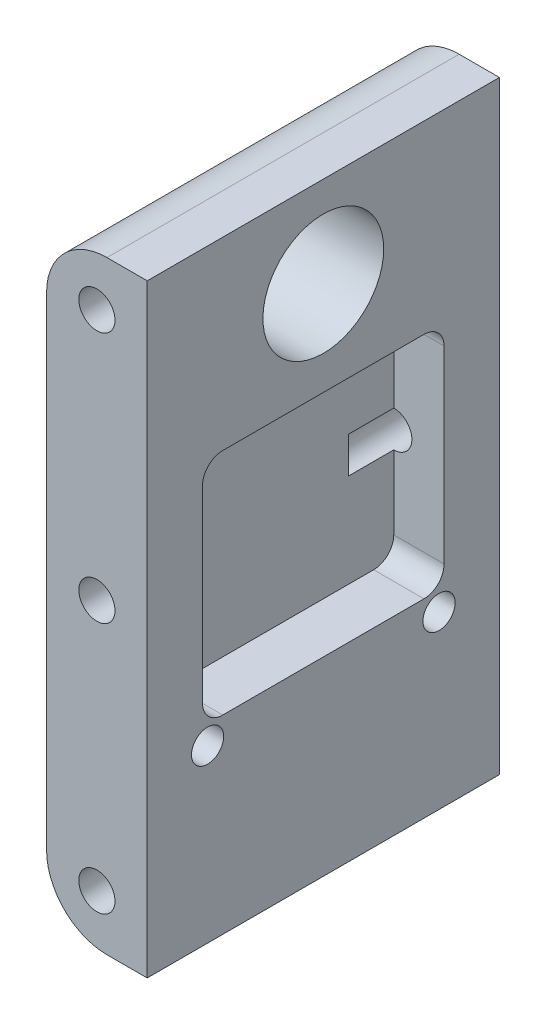
ISO-10303-21;
HEADER;
FILE_DESCRIPTION(('STEP AP214'),'2;1');
FILE_NAME('part.step','',(''),(''),'','','');
FILE_SCHEMA(('AUTOMOTIVE_DESIGN { 1 0 10303 214 1 1 1 1 }'));
ENDSEC;
DATA;
#1=APPLICATION_CONTEXT('core data for automotive mechanical design processes');
#2=APPLICATION_PROTOCOL_DEFINITION('international standard','automotive_design',2000,#1);
#3=PRODUCT_CONTEXT('',#1,'mechanical');
#4=PRODUCT('Part','Part','',(#3));
#5=PRODUCT_RELATED_PRODUCT_CATEGORY('part','',(#4));
#6=PRODUCT_DEFINITION_FORMATION('','',#4);
#7=PRODUCT_DEFINITION_CONTEXT('part definition',#1,'design');
#8=PRODUCT_DEFINITION('design','',#6,#7);
#9=PRODUCT_DEFINITION_SHAPE('','',#8);
#10=(LENGTH_UNIT() NAMED_UNIT(*) SI_UNIT(.MILLI.,.METRE.));
#11=(NAMED_UNIT(*) PLANE_ANGLE_UNIT() SI_UNIT($,.RADIAN.));
#12=(NAMED_UNIT(*) SI_UNIT($,.STERADIAN.) SOLID_ANGLE_UNIT());
#13=UNCERTAINTY_MEASURE_WITH_UNIT(LENGTH_MEASURE(1.E-05),#10,'distance_accuracy_value','');
#14=(GEOMETRIC_REPRESENTATION_CONTEXT(3) GLOBAL_UNCERTAINTY_ASSIGNED_CONTEXT((#13)) GLOBAL_UNIT_ASSIGNED_CONTEXT((#10,
#11,#12)) REPRESENTATION_CONTEXT('',''));
#15=CARTESIAN_POINT('',(0.,0.,0.));
#16=DIRECTION('',(0.,0.,1.));
#17=DIRECTION('',(1.,0.,0.));
#18=AXIS2_PLACEMENT_3D('',#15,#16,#17);
#19=CARTESIAN_POINT('',(10.,0.,0.));
#20=DIRECTION('',(-1.,0.,0.));
#21=DIRECTION('',(0.,0.,1.));
#22=AXIS2_PLACEMENT_3D('',#19,#20,#21);
#23=PLANE('',#22);
#24=DIRECTION('',(0.,0.,1.));
#25=VECTOR('',#24,1.);
#26=CARTESIAN_POINT('',(10.,41.6401580107337,-7.50000000000002));
#27=LINE('',#26,#25);
#28=CARTESIAN_POINT('',(10.,41.6401580107337,-27.5));
#29=VERTEX_POINT('',#28);
#30=CARTESIAN_POINT('',(10.,41.6401580107337,-7.50000000000002));
#31=VERTEX_POINT('',#30);
#32=EDGE_CURVE('E215',#29,#31,#27,.T.);
#33=ORIENTED_EDGE('',*,*,#32,.F.);
#34=CARTESIAN_POINT('',(10.,39.6401580107337,-27.5));
#35=DIRECTION('',(1.,0.,0.));
#36=DIRECTION('',(0.,0.,1.));
#37=AXIS2_PLACEMENT_3D('',#34,#35,#36);
#38=CIRCLE('',#37,2.);
#39=CARTESIAN_POINT('',(10.,39.6401580107337,-29.5));
#40=VERTEX_POINT('',#39);
#41=EDGE_CURVE('E173',#40,#29,#38,.T.);
#42=ORIENTED_EDGE('',*,*,#41,.F.);
#43=DIRECTION('',(0.,1.,0.));
#44=VECTOR('',#43,1.);
#45=CARTESIAN_POINT('',(10.,39.6401580107337,-29.5));
#46=LINE('',#45,#44);
#47=CARTESIAN_POINT('',(10.,20.881008271694,-29.5));
#48=VERTEX_POINT('',#47);
#49=EDGE_CURVE('E192',#48,#40,#46,.T.);
#50=ORIENTED_EDGE('',*,*,#49,.F.);
#51=CARTESIAN_POINT('',(10.,20.881008271694,-27.5));
#52=DIRECTION('',(1.,0.,0.));
#53=DIRECTION('',(0.,0.,1.));
#54=AXIS2_PLACEMENT_3D('',#51,#52,#53);
#55=CIRCLE('',#54,2.);
#56=CARTESIAN_POINT('',(10.,18.881008271694,-27.5));
#57=VERTEX_POINT('',#56);
#58=EDGE_CURVE('E195',#57,#48,#55,.T.);
#59=ORIENTED_EDGE('',*,*,#58,.F.);
#60=DIRECTION('',(0.,0.,-1.));
#61=VECTOR('',#60,1.);
#62=CARTESIAN_POINT('',(10.,18.881008271694,-7.50000000000002));
#63=LINE('',#62,#61);
#64=CARTESIAN_POINT('',(10.,18.881008271694,-7.50000000000002));
#65=VERTEX_POINT('',#64);
#66=EDGE_CURVE('E226',#65,#57,#63,.T.);
#67=ORIENTED_EDGE('',*,*,#66,.F.);
#68=CARTESIAN_POINT('',(10.,20.881008271694,-7.50000000000001));
#69=DIRECTION('',(1.,0.,0.));
#70=DIRECTION('',(0.,0.,-1.));
#71=AXIS2_PLACEMENT_3D('',#68,#69,#70);
#72=CIRCLE('',#71,2.);
#73=CARTESIAN_POINT('',(10.,20.881008271694,-5.50000000000001));
#74=VERTEX_POINT('',#73);
#75=EDGE_CURVE('E223',#74,#65,#72,.T.);
#76=ORIENTED_EDGE('',*,*,#75,.F.);
#77=DIRECTION('',(0.,-1.,0.));
#78=VECTOR('',#77,1.);
#79=CARTESIAN_POINT('',(10.,31.881008271694,-5.50000000000001));
#80=LINE('',#79,#78);
#81=CARTESIAN_POINT('',(10.,39.6401580107337,-5.5));
#82=VERTEX_POINT('',#81);
#83=EDGE_CURVE('E220',#82,#74,#80,.T.);
#84=ORIENTED_EDGE('',*,*,#83,.F.);
#85=CARTESIAN_POINT('',(10.,39.6401580107337,-7.50000000000001));
#86=DIRECTION('',(1.,0.,0.));
#87=DIRECTION('',(0.,0.,1.));
#88=AXIS2_PLACEMENT_3D('',#85,#86,#87);
#89=CIRCLE('',#88,2.);
#90=EDGE_CURVE('E217',#31,#82,#89,.T.);
#91=ORIENTED_EDGE('',*,*,#90,.F.);
#92=EDGE_LOOP('',(#33,#42,#50,#59,#67,#76,#84,#91));
#93=FACE_BOUND('',#92,.T.);
#94=DIRECTION('',(0.,-1.,0.));
#95=VECTOR('',#94,1.);
#96=CARTESIAN_POINT('',(10.,0.,0.));
#97=LINE('',#96,#95);
#98=CARTESIAN_POINT('',(10.,60.,0.));
#99=VERTEX_POINT('',#98);
#100=CARTESIAN_POINT('',(10.,0.,0.));
#101=VERTEX_POINT('',#100);
#102=EDGE_CURVE('E312',#99,#101,#97,.T.);
#103=ORIENTED_EDGE('',*,*,#102,.T.);
#104=DIRECTION('',(0.,0.,-1.));
#105=VECTOR('',#104,1.);
#106=CARTESIAN_POINT('',(10.,0.,0.));
#107=LINE('',#106,#105);
#108=CARTESIAN_POINT('',(10.,0.,-35.));
#109=VERTEX_POINT('',#108);
#110=EDGE_CURVE('E315',#101,#109,#107,.T.);
#111=ORIENTED_EDGE('',*,*,#110,.T.);
#112=DIRECTION('',(0.,1.,0.));
#113=VECTOR('',#112,1.);
#114=CARTESIAN_POINT('',(10.,60.,-35.));
#115=LINE('',#114,#113);
#116=CARTESIAN_POINT('',(10.,60.,-35.));
#117=VERTEX_POINT('',#116);
#118=EDGE_CURVE('E318',#109,#117,#115,.T.);
#119=ORIENTED_EDGE('',*,*,#118,.T.);
#120=DIRECTION('',(0.,0.,1.));
#121=VECTOR('',#120,1.);
#122=CARTESIAN_POINT('',(10.,60.,0.));
#123=LINE('',#122,#121);
#124=EDGE_CURVE('E320',#117,#99,#123,.T.);
#125=ORIENTED_EDGE('',*,*,#124,.T.);
#126=EDGE_LOOP('',(#103,#111,#119,#125));
#127=FACE_BOUND('',#126,.T.);
#128=CARTESIAN_POINT('',(10.,51.,-17.5));
#129=DIRECTION('',(1.,0.,0.));
#130=DIRECTION('',(0.,0.,-1.));
#131=AXIS2_PLACEMENT_3D('',#128,#129,#130);
#132=CIRCLE('',#131,6.);
#133=CARTESIAN_POINT('',(10.,51.,-23.5));
#134=VERTEX_POINT('',#133);
#135=EDGE_CURVE('E307',#134,#134,#132,.T.);
#136=ORIENTED_EDGE('',*,*,#135,.F.);
#137=EDGE_LOOP('',(#136));
#138=FACE_BOUND('',#137,.T.);
#139=CARTESIAN_POINT('',(10.,17.,-6.));
#140=DIRECTION('',(1.,0.,0.));
#141=DIRECTION('',(0.,0.,-1.));
#142=AXIS2_PLACEMENT_3D('',#139,#140,#141);
#143=CIRCLE('',#142,1.6);
#144=CARTESIAN_POINT('',(10.,17.,-7.6));
#145=VERTEX_POINT('',#144);
#146=EDGE_CURVE('E301',#145,#145,#143,.T.);
#147=ORIENTED_EDGE('',*,*,#146,.F.);
#148=EDGE_LOOP('',(#147));
#149=FACE_BOUND('',#148,.T.);
#150=CARTESIAN_POINT('',(10.,17.,-29.));
#151=DIRECTION('',(1.,0.,0.));
#152=DIRECTION('',(0.,0.,-1.));
#153=AXIS2_PLACEMENT_3D('',#150,#151,#152);
#154=CIRCLE('',#153,1.6);
#155=CARTESIAN_POINT('',(10.,17.,-30.6));
#156=VERTEX_POINT('',#155);
#157=EDGE_CURVE('E295',#156,#156,#154,.T.);
#158=ORIENTED_EDGE('',*,*,#157,.F.);
#159=EDGE_LOOP('',(#158));
#160=FACE_BOUND('',#159,.T.);
#161=ADVANCED_FACE('F34',(#93,#127,#138,#149,#160),#23,.F.);
#162=CARTESIAN_POINT('',(0.,0.,0.));
#163=DIRECTION('',(-1.,0.,0.));
#164=DIRECTION('',(0.,0.,1.));
#165=AXIS2_PLACEMENT_3D('',#162,#163,#164);
#166=PLANE('',#165);
#167=CARTESIAN_POINT('',(0.,17.,-6.));
#168=DIRECTION('',(1.,0.,0.));
#169=DIRECTION('',(0.,0.,-1.));
#170=AXIS2_PLACEMENT_3D('',#167,#168,#169);
#171=CIRCLE('',#170,1.6);
#172=CARTESIAN_POINT('',(0.,17.,-7.6));
#173=VERTEX_POINT('',#172);
#174=EDGE_CURVE('E298',#173,#173,#171,.T.);
#175=ORIENTED_EDGE('',*,*,#174,.T.);
#176=EDGE_LOOP('',(#175));
#177=FACE_BOUND('',#176,.T.);
#178=DIRECTION('',(0.,-1.,0.));
#179=VECTOR('',#178,1.);
#180=CARTESIAN_POINT('',(0.,0.,0.));
#181=LINE('',#180,#179);
#182=CARTESIAN_POINT('',(0.,54.,0.));
#183=VERTEX_POINT('',#182);
#184=CARTESIAN_POINT('',(0.,6.,0.));
#185=VERTEX_POINT('',#184);
#186=EDGE_CURVE('E310',#183,#185,#181,.T.);
#187=ORIENTED_EDGE('',*,*,#186,.F.);
#188=DIRECTION('',(0.,0.,1.));
#189=VECTOR('',#188,1.);
#190=CARTESIAN_POINT('',(0.,54.,-35.));
#191=LINE('',#190,#189);
#192=CARTESIAN_POINT('',(0.,54.,-12.3038475772934));
#193=VERTEX_POINT('',#192);
#194=EDGE_CURVE('E56',#183,#193,#191,.F.);
#195=ORIENTED_EDGE('',*,*,#194,.T.);
#196=CARTESIAN_POINT('',(0.,51.,-17.5));
#197=DIRECTION('',(1.,0.,0.));
#198=DIRECTION('',(0.,0.,-1.));
#199=AXIS2_PLACEMENT_3D('',#196,#197,#198);
#200=CIRCLE('',#199,6.);
#201=CARTESIAN_POINT('',(0.,54.,-22.6961524227066));
#202=VERTEX_POINT('',#201);
#203=EDGE_CURVE('E304',#193,#202,#200,.T.);
#204=ORIENTED_EDGE('',*,*,#203,.T.);
#205=DIRECTION('',(0.,0.,1.));
#206=VECTOR('',#205,1.);
#207=CARTESIAN_POINT('',(0.,54.,-35.));
#208=LINE('',#207,#206);
#209=CARTESIAN_POINT('',(0.,54.,-35.));
#210=VERTEX_POINT('',#209);
#211=EDGE_CURVE('E355',#202,#210,#208,.F.);
#212=ORIENTED_EDGE('',*,*,#211,.T.);
#213=DIRECTION('',(0.,1.,0.));
#214=VECTOR('',#213,1.);
#215=CARTESIAN_POINT('',(0.,60.,-35.));
#216=LINE('',#215,#214);
#217=CARTESIAN_POINT('',(0.,6.,-35.));
#218=VERTEX_POINT('',#217);
#219=EDGE_CURVE('E316',#218,#210,#216,.T.);
#220=ORIENTED_EDGE('',*,*,#219,.F.);
#221=DIRECTION('',(0.,0.,-1.));
#222=VECTOR('',#221,1.);
#223=CARTESIAN_POINT('',(0.,6.,0.));
#224=LINE('',#223,#222);
#225=EDGE_CURVE('E353',#218,#185,#224,.F.);
#226=ORIENTED_EDGE('',*,*,#225,.T.);
#227=EDGE_LOOP('',(#187,#195,#204,#212,#220,#226));
#228=FACE_BOUND('',#227,.T.);
#229=CARTESIAN_POINT('',(0.,17.,-29.));
#230=DIRECTION('',(1.,0.,0.));
#231=DIRECTION('',(0.,0.,-1.));
#232=AXIS2_PLACEMENT_3D('',#229,#230,#231);
#233=CIRCLE('',#232,1.6);
#234=CARTESIAN_POINT('',(0.,17.,-30.6));
#235=VERTEX_POINT('',#234);
#236=EDGE_CURVE('E280',#235,#235,#233,.T.);
#237=ORIENTED_EDGE('',*,*,#236,.T.);
#238=EDGE_LOOP('',(#237));
#239=FACE_BOUND('',#238,.T.);
#240=ADVANCED_FACE('F378',(#177,#228,#239),#166,.T.);
#241=CARTESIAN_POINT('',(10.,0.,0.));
#242=DIRECTION('',(0.,0.,-1.));
#243=DIRECTION('',(-1.,0.,0.));
#244=AXIS2_PLACEMENT_3D('',#241,#242,#243);
#245=PLANE('',#244);
#246=CARTESIAN_POINT('',(5.,55.,0.));
#247=DIRECTION('',(0.,0.,1.));
#248=DIRECTION('',(1.,0.,0.));
#249=AXIS2_PLACEMENT_3D('',#246,#247,#248);
#250=CIRCLE('',#249,1.8);
#251=CARTESIAN_POINT('',(6.8,55.,0.));
#252=VERTEX_POINT('',#251);
#253=EDGE_CURVE('E263',#252,#252,#250,.T.);
#254=ORIENTED_EDGE('',*,*,#253,.F.);
#255=EDGE_LOOP('',(#254));
#256=FACE_BOUND('',#255,.T.);
#257=CARTESIAN_POINT('',(5.00000000000026,30.,0.));
#258=DIRECTION('',(0.,0.,1.));
#259=DIRECTION('',(1.,0.,0.));
#260=AXIS2_PLACEMENT_3D('',#257,#258,#259);
#261=CIRCLE('',#260,1.8);
#262=CARTESIAN_POINT('',(6.80000000000026,30.,0.));
#263=VERTEX_POINT('',#262);
#264=EDGE_CURVE('E269',#263,#263,#261,.T.);
#265=ORIENTED_EDGE('',*,*,#264,.F.);
#266=EDGE_LOOP('',(#265));
#267=FACE_BOUND('',#266,.T.);
#268=CARTESIAN_POINT('',(5.00000000000052,5.,0.));
#269=DIRECTION('',(0.,0.,1.));
#270=DIRECTION('',(1.,0.,0.));
#271=AXIS2_PLACEMENT_3D('',#268,#269,#270);
#272=CIRCLE('',#271,1.8);
#273=CARTESIAN_POINT('',(6.80000000000052,5.,0.));
#274=VERTEX_POINT('',#273);
#275=EDGE_CURVE('E258',#274,#274,#272,.T.);
#276=ORIENTED_EDGE('',*,*,#275,.F.);
#277=EDGE_LOOP('',(#276));
#278=FACE_BOUND('',#277,.T.);
#279=DIRECTION('',(-1.,0.,0.));
#280=VECTOR('',#279,1.);
#281=CARTESIAN_POINT('',(10.,60.,0.));
#282=LINE('',#281,#280);
#283=CARTESIAN_POINT('',(6.,60.,0.));
#284=VERTEX_POINT('',#283);
#285=EDGE_CURVE('E322',#99,#284,#282,.T.);
#286=ORIENTED_EDGE('',*,*,#285,.T.);
#287=CARTESIAN_POINT('',(6.,54.,0.));
#288=DIRECTION('',(0.,0.,-1.));
#289=DIRECTION('',(-1.,0.,0.));
#290=AXIS2_PLACEMENT_3D('',#287,#288,#289);
#291=CIRCLE('',#290,6.);
#292=EDGE_CURVE('E351',#284,#183,#291,.F.);
#293=ORIENTED_EDGE('',*,*,#292,.T.);
#294=ORIENTED_EDGE('',*,*,#186,.T.);
#295=CARTESIAN_POINT('',(6.,6.,0.));
#296=DIRECTION('',(0.,0.,-1.));
#297=DIRECTION('',(-1.,0.,0.));
#298=AXIS2_PLACEMENT_3D('',#295,#296,#297);
#299=CIRCLE('',#298,6.);
#300=CARTESIAN_POINT('',(6.,0.,0.));
#301=VERTEX_POINT('',#300);
#302=EDGE_CURVE('E349',#185,#301,#299,.F.);
#303=ORIENTED_EDGE('',*,*,#302,.T.);
#304=DIRECTION('',(-1.,0.,0.));
#305=VECTOR('',#304,1.);
#306=CARTESIAN_POINT('',(10.,0.,0.));
#307=LINE('',#306,#305);
#308=EDGE_CURVE('E335',#101,#301,#307,.T.);
#309=ORIENTED_EDGE('',*,*,#308,.F.);
#310=ORIENTED_EDGE('',*,*,#102,.F.);
#311=EDGE_LOOP('',(#286,#293,#294,#303,#309,#310));
#312=FACE_BOUND('',#311,.T.);
#313=ADVANCED_FACE('F374',(#256,#267,#278,#312),#245,.F.);
#314=CARTESIAN_POINT('',(10.,0.,0.));
#315=DIRECTION('',(0.,1.,0.));
#316=DIRECTION('',(0.,0.,1.));
#317=AXIS2_PLACEMENT_3D('',#314,#315,#316);
#318=PLANE('',#317);
#319=ORIENTED_EDGE('',*,*,#308,.T.);
#320=DIRECTION('',(0.,0.,-1.));
#321=VECTOR('',#320,1.);
#322=CARTESIAN_POINT('',(6.,0.,-35.));
#323=LINE('',#322,#321);
#324=CARTESIAN_POINT('',(6.,0.,-35.));
#325=VERTEX_POINT('',#324);
#326=EDGE_CURVE('E11',#301,#325,#323,.T.);
#327=ORIENTED_EDGE('',*,*,#326,.T.);
#328=DIRECTION('',(-1.,0.,0.));
#329=VECTOR('',#328,1.);
#330=CARTESIAN_POINT('',(10.,0.,-35.));
#331=LINE('',#330,#329);
#332=EDGE_CURVE('E332',#109,#325,#331,.T.);
#333=ORIENTED_EDGE('',*,*,#332,.F.);
#334=ORIENTED_EDGE('',*,*,#110,.F.);
#335=EDGE_LOOP('',(#319,#327,#333,#334));
#336=FACE_BOUND('',#335,.T.);
#337=ADVANCED_FACE('F377',(#336),#318,.F.);
#338=CARTESIAN_POINT('',(10.,60.,-35.));
#339=DIRECTION('',(0.,0.,1.));
#340=DIRECTION('',(1.,0.,0.));
#341=AXIS2_PLACEMENT_3D('',#338,#339,#340);
#342=PLANE('',#341);
#343=CARTESIAN_POINT('',(5.,55.,-35.));
#344=DIRECTION('',(0.,0.,-1.));
#345=DIRECTION('',(-1.,0.,0.));
#346=AXIS2_PLACEMENT_3D('',#343,#344,#345);
#347=CIRCLE('',#346,1.8);
#348=CARTESIAN_POINT('',(3.2,55.,-35.));
#349=VERTEX_POINT('',#348);
#350=EDGE_CURVE('E281',#349,#349,#347,.T.);
#351=ORIENTED_EDGE('',*,*,#350,.F.);
#352=EDGE_LOOP('',(#351));
#353=FACE_BOUND('',#352,.T.);
#354=CARTESIAN_POINT('',(4.99999999999974,30.,-35.));
#355=DIRECTION('',(0.,0.,-1.));
#356=DIRECTION('',(-1.,0.,0.));
#357=AXIS2_PLACEMENT_3D('',#354,#355,#356);
#358=CIRCLE('',#357,1.8);
#359=CARTESIAN_POINT('',(3.19999999999974,30.,-35.));
#360=VERTEX_POINT('',#359);
#361=EDGE_CURVE('E287',#360,#360,#358,.T.);
#362=ORIENTED_EDGE('',*,*,#361,.F.);
#363=EDGE_LOOP('',(#362));
#364=FACE_BOUND('',#363,.T.);
#365=CARTESIAN_POINT('',(4.99999999999948,5.,-35.));
#366=DIRECTION('',(0.,0.,-1.));
#367=DIRECTION('',(-1.,0.,0.));
#368=AXIS2_PLACEMENT_3D('',#365,#366,#367);
#369=CIRCLE('',#368,1.8);
#370=CARTESIAN_POINT('',(3.19999999999948,5.,-35.));
#371=VERTEX_POINT('',#370);
#372=EDGE_CURVE('E262',#371,#371,#369,.T.);
#373=ORIENTED_EDGE('',*,*,#372,.F.);
#374=EDGE_LOOP('',(#373));
#375=FACE_BOUND('',#374,.T.);
#376=ORIENTED_EDGE('',*,*,#219,.T.);
#377=CARTESIAN_POINT('',(6.,54.,-35.));
#378=DIRECTION('',(0.,0.,1.));
#379=DIRECTION('',(1.,0.,0.));
#380=AXIS2_PLACEMENT_3D('',#377,#378,#379);
#381=CIRCLE('',#380,6.);
#382=CARTESIAN_POINT('',(6.,60.,-35.));
#383=VERTEX_POINT('',#382);
#384=EDGE_CURVE('E42',#210,#383,#381,.F.);
#385=ORIENTED_EDGE('',*,*,#384,.T.);
#386=DIRECTION('',(-1.,0.,0.));
#387=VECTOR('',#386,1.);
#388=CARTESIAN_POINT('',(10.,60.,-35.));
#389=LINE('',#388,#387);
#390=EDGE_CURVE('E329',#117,#383,#389,.T.);
#391=ORIENTED_EDGE('',*,*,#390,.F.);
#392=ORIENTED_EDGE('',*,*,#118,.F.);
#393=ORIENTED_EDGE('',*,*,#332,.T.);
#394=CARTESIAN_POINT('',(6.,6.,-35.));
#395=DIRECTION('',(0.,0.,1.));
#396=DIRECTION('',(1.,0.,0.));
#397=AXIS2_PLACEMENT_3D('',#394,#395,#396);
#398=CIRCLE('',#397,6.);
#399=EDGE_CURVE('E49',#325,#218,#398,.F.);
#400=ORIENTED_EDGE('',*,*,#399,.T.);
#401=EDGE_LOOP('',(#376,#385,#391,#392,#393,#400));
#402=FACE_BOUND('',#401,.T.);
#403=ADVANCED_FACE('F382',(#353,#364,#375,#402),#342,.F.);
#404=CARTESIAN_POINT('',(10.,60.,0.));
#405=DIRECTION('',(0.,-1.,0.));
#406=DIRECTION('',(0.,0.,-1.));
#407=AXIS2_PLACEMENT_3D('',#404,#405,#406);
#408=PLANE('',#407);
#409=ORIENTED_EDGE('',*,*,#390,.T.);
#410=DIRECTION('',(0.,0.,1.));
#411=VECTOR('',#410,1.);
#412=CARTESIAN_POINT('',(6.,60.,0.));
#413=LINE('',#412,#411);
#414=EDGE_CURVE('E346',#383,#284,#413,.T.);
#415=ORIENTED_EDGE('',*,*,#414,.T.);
#416=ORIENTED_EDGE('',*,*,#285,.F.);
#417=ORIENTED_EDGE('',*,*,#124,.F.);
#418=EDGE_LOOP('',(#409,#415,#416,#417));
#419=FACE_BOUND('',#418,.T.);
#420=ADVANCED_FACE('F386',(#419),#408,.F.);
#421=CARTESIAN_POINT('',(10.,51.,-17.5));
#422=DIRECTION('',(-1.,0.,0.));
#423=DIRECTION('',(0.,0.,1.));
#424=AXIS2_PLACEMENT_3D('',#421,#422,#423);
#425=CYLINDRICAL_SURFACE('',#424,6.);
#426=ORIENTED_EDGE('',*,*,#135,.T.);
#427=EDGE_LOOP('',(#426));
#428=FACE_BOUND('',#427,.T.);
#429=ORIENTED_EDGE('',*,*,#203,.F.);
#430=CARTESIAN_POINT('',(0.,54.,-12.3038475772934));
#431=CARTESIAN_POINT('',(-1.70318691964767E-05,54.138971489971,-12.3840486609694));
#432=CARTESIAN_POINT('',(0.004826564341127,54.2746087440341,-12.4698234963983));
#433=CARTESIAN_POINT('',(0.0227239424648481,54.5380740534339,-12.6515453539032));
#434=CARTESIAN_POINT('',(0.0357670906650158,54.6659119882295,-12.747479067494));
#435=CARTESIAN_POINT('',(0.0684624467663157,54.9122658926771,-12.9481552580847));
#436=CARTESIAN_POINT('',(0.0880747779846383,55.0308329071765,-13.0528417927466));
#437=CARTESIAN_POINT('',(0.132395671677967,55.2588578109537,-13.2706941914864));
#438=CARTESIAN_POINT('',(0.157105871638557,55.3683127574512,-13.3838627726258));
#439=CARTESIAN_POINT('',(0.2363738701154,55.6812857302597,-13.7339552919189));
#440=CARTESIAN_POINT('',(0.296277933209233,55.8707497970105,-13.9825625930407));
#441=CARTESIAN_POINT('',(0.387873584499626,56.1241866180133,-14.3747622922179));
#442=CARTESIAN_POINT('',(0.418742446001198,56.2036338384799,-14.508923554784));
#443=CARTESIAN_POINT('',(0.479610319044134,56.3519592810563,-14.7832350066012));
#444=CARTESIAN_POINT('',(0.50960924488321,56.4208364647014,-14.9233857825714));
#445=CARTESIAN_POINT('',(0.57008725692433,56.553801168399,-15.2230007441497));
#446=CARTESIAN_POINT('',(0.600326834879387,56.6167630432964,-15.3830139628661));
#447=CARTESIAN_POINT('',(0.656120625714184,56.7288967700485,-15.708533221189));
#448=CARTESIAN_POINT('',(0.681676907906104,56.7780747174361,-15.874036796521));
#449=CARTESIAN_POINT('',(0.726396540192259,56.8620575418262,-16.2092319722415));
#450=CARTESIAN_POINT('',(0.745569989964516,56.8968851466135,-16.3789164956155));
#451=CARTESIAN_POINT('',(0.7762114546111,56.9517844390372,-16.721339033517));
#452=CARTESIAN_POINT('',(0.787680699206749,56.9718584816397,-16.8940765562146));
#453=CARTESIAN_POINT('',(0.801430111553232,56.9958369707298,-17.2258699949614));
#454=CARTESIAN_POINT('',(0.804423916108371,57.0009979900945,-17.3848064852442));
#455=CARTESIAN_POINT('',(0.803087652985968,56.9986840201315,-17.7025528520796));
#456=CARTESIAN_POINT('',(0.798757931373836,56.9912096278766,-17.8613627342602));
#457=CARTESIAN_POINT('',(0.783051709346282,56.9637303076266,-18.1775843979837));
#458=CARTESIAN_POINT('',(0.771672956141471,56.9437213737133,-18.3349957162419));
#459=CARTESIAN_POINT('',(0.74258001036149,56.8914400770858,-18.6471630649126));
#460=CARTESIAN_POINT('',(0.724865730184451,56.8591675448015,-18.8019190585787));
#461=CARTESIAN_POINT('',(0.685478607930235,56.7852280548295,-19.0977630415463));
#462=CARTESIAN_POINT('',(0.664139298092433,56.7443110873645,-19.2390841758154));
#463=CARTESIAN_POINT('',(0.617873224520897,56.6524235210254,-19.5178348107684));
#464=CARTESIAN_POINT('',(0.592945361557728,56.601449839845,-19.6552631035213));
#465=CARTESIAN_POINT('',(0.514428407863169,56.4338799823086,-20.0609774484928));
#466=CARTESIAN_POINT('',(0.457117523498166,56.3026548260349,-20.322614360533));
#467=CARTESIAN_POINT('',(0.334333473326662,55.9832379765415,-20.858159459369));
#468=CARTESIAN_POINT('',(0.268807912423602,55.7897327274657,-21.1289159349087));
#469=CARTESIAN_POINT('',(0.181050536064394,55.4670543183315,-21.5091186441178));
#470=CARTESIAN_POINT('',(0.153568408184191,55.3541794816466,-21.6314562222759));
#471=CARTESIAN_POINT('',(0.103862999574718,55.118083219865,-21.8668238822048));
#472=CARTESIAN_POINT('',(0.081637108831873,54.9948669712111,-21.9798585651222));
#473=CARTESIAN_POINT('',(0.0433054162393705,54.7322837248737,-22.2011658255451));
#474=CARTESIAN_POINT('',(0.0275648439157112,54.5924155759533,-22.3089106488047));
#475=CARTESIAN_POINT('',(0.0058941424161629,54.3030711086184,-22.5121006928568));
#476=CARTESIAN_POINT('',(-2.41089792427208E-05,54.1535833840671,-22.6075308936609));
#477=CARTESIAN_POINT('',(0.,54.,-22.6961524227066));
#478=B_SPLINE_CURVE_WITH_KNOTS('',3,(#430,#431,#432,#433,#434,#435,#436,#437,#438,#439,#440,
#441,#442,#443,#444,#445,#446,#447,#448,#449,#450,#451,#452,#453,#454,#455,#456,#457,#458,#459,
#460,#461,#462,#463,#464,#465,#466,#467,#468,#469,#470,#471,#472,#473,#474,#475,#476,#477),
.UNSPECIFIED.,.F.,.F.,(4,2,2,2,2,2,2,2,2,2,2,2,2,2,2,2,2,2,2,2,2,2,2,4),(0.,0.481007244724744,
0.96139197115481,1.43891194475274,1.91658554194476,2.86676478085739,3.34326908663013,
3.81982017715403,4.34293663731535,4.86582139843953,5.38787481215915,5.90984487751972,
6.38633112647706,6.86279486021444,7.33941094489037,7.816033620032,8.26157062121815,
8.70724438883857,9.5988350843745,10.6113996532194,11.1169923893763,11.6223335410446,
12.1531632104413,12.6846343266553),.UNSPECIFIED.);
#479=EDGE_CURVE('E358',#193,#202,#478,.T.);
#480=ORIENTED_EDGE('',*,*,#479,.T.);
#481=EDGE_LOOP('',(#429,#480));
#482=FACE_BOUND('',#481,.T.);
#483=ADVANCED_FACE('F365',(#428,#482),#425,.F.);
#484=CARTESIAN_POINT('',(10.,17.,-6.));
#485=DIRECTION('',(-1.,0.,0.));
#486=DIRECTION('',(0.,0.,1.));
#487=AXIS2_PLACEMENT_3D('',#484,#485,#486);
#488=CYLINDRICAL_SURFACE('',#487,1.6);
#489=ORIENTED_EDGE('',*,*,#146,.T.);
#490=EDGE_LOOP('',(#489));
#491=FACE_BOUND('',#490,.T.);
#492=ORIENTED_EDGE('',*,*,#174,.F.);
#493=EDGE_LOOP('',(#492));
#494=FACE_BOUND('',#493,.T.);
#495=ADVANCED_FACE('F412',(#491,#494),#488,.F.);
#496=CARTESIAN_POINT('',(10.,17.,-29.));
#497=DIRECTION('',(-1.,0.,0.));
#498=DIRECTION('',(0.,0.,1.));
#499=AXIS2_PLACEMENT_3D('',#496,#497,#498);
#500=CYLINDRICAL_SURFACE('',#499,1.6);
#501=ORIENTED_EDGE('',*,*,#157,.T.);
#502=EDGE_LOOP('',(#501));
#503=FACE_BOUND('',#502,.T.);
#504=ORIENTED_EDGE('',*,*,#236,.F.);
#505=EDGE_LOOP('',(#504));
#506=FACE_BOUND('',#505,.T.);
#507=ADVANCED_FACE('F408',(#503,#506),#500,.F.);
#508=CARTESIAN_POINT('',(4.99999999999948,5.,-25.));
#509=DIRECTION('',(0.,0.,-1.));
#510=DIRECTION('',(-1.,0.,0.));
#511=AXIS2_PLACEMENT_3D('',#508,#509,#510);
#512=CYLINDRICAL_SURFACE('',#511,1.8);
#513=CARTESIAN_POINT('',(4.99999999999948,5.,-25.));
#514=DIRECTION('',(0.,0.,-1.));
#515=DIRECTION('',(-1.,0.,0.));
#516=AXIS2_PLACEMENT_3D('',#513,#514,#515);
#517=CIRCLE('',#516,1.8);
#518=CARTESIAN_POINT('',(3.19999999999948,5.,-25.));
#519=VERTEX_POINT('',#518);
#520=EDGE_CURVE('E290',#519,#519,#517,.T.);
#521=ORIENTED_EDGE('',*,*,#520,.F.);
#522=EDGE_LOOP('',(#521));
#523=FACE_BOUND('',#522,.T.);
#524=ORIENTED_EDGE('',*,*,#372,.T.);
#525=EDGE_LOOP('',(#524));
#526=FACE_BOUND('',#525,.T.);
#527=ADVANCED_FACE('F411',(#523,#526),#512,.F.);
#528=CARTESIAN_POINT('',(4.99999999999948,5.,-25.));
#529=DIRECTION('',(0.,0.,-1.));
#530=DIRECTION('',(-1.,0.,0.));
#531=AXIS2_PLACEMENT_3D('',#528,#529,#530);
#532=PLANE('',#531);
#533=ORIENTED_EDGE('',*,*,#520,.T.);
#534=EDGE_LOOP('',(#533));
#535=FACE_BOUND('',#534,.T.);
#536=ADVANCED_FACE('F420',(#535),#532,.T.);
#537=CARTESIAN_POINT('',(4.99999999999974,30.,-25.));
#538=DIRECTION('',(0.,0.,-1.));
#539=DIRECTION('',(-1.,0.,0.));
#540=AXIS2_PLACEMENT_3D('',#537,#538,#539);
#541=CYLINDRICAL_SURFACE('',#540,1.8);
#542=CARTESIAN_POINT('',(4.99999999999974,30.,-29.5));
#543=DIRECTION('',(0.,0.,-1.));
#544=DIRECTION('',(-1.,0.,0.));
#545=AXIS2_PLACEMENT_3D('',#542,#543,#544);
#546=CIRCLE('',#545,1.8);
#547=CARTESIAN_POINT('',(5.,28.2,-29.5));
#548=VERTEX_POINT('',#547);
#549=CARTESIAN_POINT('',(5.,31.8,-29.5));
#550=VERTEX_POINT('',#549);
#551=EDGE_CURVE('E343',#548,#550,#546,.F.);
#552=ORIENTED_EDGE('',*,*,#551,.T.);
#553=DIRECTION('',(0.,0.,-1.));
#554=VECTOR('',#553,1.);
#555=CARTESIAN_POINT('',(5.,31.8,-25.));
#556=LINE('',#555,#554);
#557=CARTESIAN_POINT('',(4.99999999999974,31.8,-25.));
#558=VERTEX_POINT('',#557);
#559=EDGE_CURVE('E255',#550,#558,#556,.F.);
#560=ORIENTED_EDGE('',*,*,#559,.T.);
#561=CARTESIAN_POINT('',(4.99999999999974,30.,-25.));
#562=DIRECTION('',(0.,0.,-1.));
#563=DIRECTION('',(-1.,0.,0.));
#564=AXIS2_PLACEMENT_3D('',#561,#562,#563);
#565=CIRCLE('',#564,1.8);
#566=CARTESIAN_POINT('',(4.99999999999974,28.2,-25.));
#567=VERTEX_POINT('',#566);
#568=EDGE_CURVE('E284',#567,#558,#565,.T.);
#569=ORIENTED_EDGE('',*,*,#568,.F.);
#570=DIRECTION('',(0.,0.,-1.));
#571=VECTOR('',#570,1.);
#572=CARTESIAN_POINT('',(5.,28.2,-25.));
#573=LINE('',#572,#571);
#574=EDGE_CURVE('E252',#567,#548,#573,.T.);
#575=ORIENTED_EDGE('',*,*,#574,.T.);
#576=EDGE_LOOP('',(#552,#560,#569,#575));
#577=FACE_BOUND('',#576,.T.);
#578=ORIENTED_EDGE('',*,*,#361,.T.);
#579=EDGE_LOOP('',(#578));
#580=FACE_BOUND('',#579,.T.);
#581=ADVANCED_FACE('F427',(#577,#580),#541,.F.);
#582=CARTESIAN_POINT('',(4.99999999999974,30.,-25.));
#583=DIRECTION('',(0.,0.,-1.));
#584=DIRECTION('',(-1.,0.,0.));
#585=AXIS2_PLACEMENT_3D('',#582,#583,#584);
#586=PLANE('',#585);
#587=DIRECTION('',(0.,1.,0.));
#588=VECTOR('',#587,1.);
#589=CARTESIAN_POINT('',(4.99999999999974,30.,-25.));
#590=LINE('',#589,#588);
#591=EDGE_CURVE('E250',#567,#558,#590,.T.);
#592=ORIENTED_EDGE('',*,*,#591,.F.);
#593=ORIENTED_EDGE('',*,*,#568,.T.);
#594=EDGE_LOOP('',(#592,#593));
#595=FACE_BOUND('',#594,.T.);
#596=ADVANCED_FACE('F431',(#595),#586,.T.);
#597=CARTESIAN_POINT('',(5.,55.,-25.));
#598=DIRECTION('',(0.,0.,-1.));
#599=DIRECTION('',(-1.,0.,0.));
#600=AXIS2_PLACEMENT_3D('',#597,#598,#599);
#601=CYLINDRICAL_SURFACE('',#600,1.8);
#602=CARTESIAN_POINT('',(5.,55.,-25.));
#603=DIRECTION('',(0.,0.,-1.));
#604=DIRECTION('',(-1.,0.,0.));
#605=AXIS2_PLACEMENT_3D('',#602,#603,#604);
#606=CIRCLE('',#605,1.8);
#607=CARTESIAN_POINT('',(3.2,55.,-25.));
#608=VERTEX_POINT('',#607);
#609=EDGE_CURVE('E277',#608,#608,#606,.T.);
#610=ORIENTED_EDGE('',*,*,#609,.F.);
#611=EDGE_LOOP('',(#610));
#612=FACE_BOUND('',#611,.T.);
#613=ORIENTED_EDGE('',*,*,#350,.T.);
#614=EDGE_LOOP('',(#613));
#615=FACE_BOUND('',#614,.T.);
#616=ADVANCED_FACE('F435',(#612,#615),#601,.F.);
#617=CARTESIAN_POINT('',(5.,55.,-25.));
#618=DIRECTION('',(0.,0.,-1.));
#619=DIRECTION('',(-1.,0.,0.));
#620=AXIS2_PLACEMENT_3D('',#617,#618,#619);
#621=PLANE('',#620);
#622=ORIENTED_EDGE('',*,*,#609,.T.);
#623=EDGE_LOOP('',(#622));
#624=FACE_BOUND('',#623,.T.);
#625=ADVANCED_FACE('F439',(#624),#621,.T.);
#626=CARTESIAN_POINT('',(5.00000000000052,5.,-10.));
#627=DIRECTION('',(0.,0.,1.));
#628=DIRECTION('',(1.,0.,0.));
#629=AXIS2_PLACEMENT_3D('',#626,#627,#628);
#630=CYLINDRICAL_SURFACE('',#629,1.8);
#631=CARTESIAN_POINT('',(5.00000000000052,5.,-10.));
#632=DIRECTION('',(0.,0.,1.));
#633=DIRECTION('',(1.,0.,0.));
#634=AXIS2_PLACEMENT_3D('',#631,#632,#633);
#635=CIRCLE('',#634,1.8);
#636=CARTESIAN_POINT('',(6.80000000000052,5.,-10.));
#637=VERTEX_POINT('',#636);
#638=EDGE_CURVE('E272',#637,#637,#635,.T.);
#639=ORIENTED_EDGE('',*,*,#638,.F.);
#640=EDGE_LOOP('',(#639));
#641=FACE_BOUND('',#640,.T.);
#642=ORIENTED_EDGE('',*,*,#275,.T.);
#643=EDGE_LOOP('',(#642));
#644=FACE_BOUND('',#643,.T.);
#645=ADVANCED_FACE('F443',(#641,#644),#630,.F.);
#646=CARTESIAN_POINT('',(5.00000000000052,5.,-10.));
#647=DIRECTION('',(0.,0.,1.));
#648=DIRECTION('',(1.,0.,0.));
#649=AXIS2_PLACEMENT_3D('',#646,#647,#648);
#650=PLANE('',#649);
#651=ORIENTED_EDGE('',*,*,#638,.T.);
#652=EDGE_LOOP('',(#651));
#653=FACE_BOUND('',#652,.T.);
#654=ADVANCED_FACE('F447',(#653),#650,.T.);
#655=CARTESIAN_POINT('',(5.00000000000026,30.,-10.));
#656=DIRECTION('',(0.,0.,1.));
#657=DIRECTION('',(1.,0.,0.));
#658=AXIS2_PLACEMENT_3D('',#655,#656,#657);
#659=CYLINDRICAL_SURFACE('',#658,1.8);
#660=CARTESIAN_POINT('',(5.00000000000026,30.,-5.50000000000001));
#661=DIRECTION('',(0.,0.,1.));
#662=DIRECTION('',(1.,0.,0.));
#663=AXIS2_PLACEMENT_3D('',#660,#661,#662);
#664=CIRCLE('',#663,1.8);
#665=CARTESIAN_POINT('',(5.,31.8,-5.50000000000001));
#666=VERTEX_POINT('',#665);
#667=CARTESIAN_POINT('',(5.,28.2,-5.50000000000001));
#668=VERTEX_POINT('',#667);
#669=EDGE_CURVE('E340',#666,#668,#664,.F.);
#670=ORIENTED_EDGE('',*,*,#669,.T.);
#671=DIRECTION('',(0.,0.,1.));
#672=VECTOR('',#671,1.);
#673=CARTESIAN_POINT('',(5.,28.2,-10.));
#674=LINE('',#673,#672);
#675=CARTESIAN_POINT('',(5.00000000000026,28.2,-10.));
#676=VERTEX_POINT('',#675);
#677=EDGE_CURVE('E247',#668,#676,#674,.F.);
#678=ORIENTED_EDGE('',*,*,#677,.T.);
#679=CARTESIAN_POINT('',(5.00000000000026,30.,-10.));
#680=DIRECTION('',(0.,0.,1.));
#681=DIRECTION('',(1.,0.,0.));
#682=AXIS2_PLACEMENT_3D('',#679,#680,#681);
#683=CIRCLE('',#682,1.8);
#684=CARTESIAN_POINT('',(5.00000000000026,31.8,-10.));
#685=VERTEX_POINT('',#684);
#686=EDGE_CURVE('E266',#685,#676,#683,.T.);
#687=ORIENTED_EDGE('',*,*,#686,.F.);
#688=DIRECTION('',(0.,0.,1.));
#689=VECTOR('',#688,1.);
#690=CARTESIAN_POINT('',(5.,31.8,-10.));
#691=LINE('',#690,#689);
#692=EDGE_CURVE('E233',#685,#666,#691,.T.);
#693=ORIENTED_EDGE('',*,*,#692,.T.);
#694=EDGE_LOOP('',(#670,#678,#687,#693));
#695=FACE_BOUND('',#694,.T.);
#696=ORIENTED_EDGE('',*,*,#264,.T.);
#697=EDGE_LOOP('',(#696));
#698=FACE_BOUND('',#697,.T.);
#699=ADVANCED_FACE('F451',(#695,#698),#659,.F.);
#700=CARTESIAN_POINT('',(5.00000000000026,30.,-10.));
#701=DIRECTION('',(0.,0.,1.));
#702=DIRECTION('',(1.,0.,0.));
#703=AXIS2_PLACEMENT_3D('',#700,#701,#702);
#704=PLANE('',#703);
#705=DIRECTION('',(0.,-1.,0.));
#706=VECTOR('',#705,1.);
#707=CARTESIAN_POINT('',(5.00000000000026,30.,-10.));
#708=LINE('',#707,#706);
#709=EDGE_CURVE('E338',#685,#676,#708,.T.);
#710=ORIENTED_EDGE('',*,*,#709,.F.);
#711=ORIENTED_EDGE('',*,*,#686,.T.);
#712=EDGE_LOOP('',(#710,#711));
#713=FACE_BOUND('',#712,.T.);
#714=ADVANCED_FACE('F455',(#713),#704,.T.);
#715=CARTESIAN_POINT('',(5.,55.,-10.));
#716=DIRECTION('',(0.,0.,1.));
#717=DIRECTION('',(1.,0.,0.));
#718=AXIS2_PLACEMENT_3D('',#715,#716,#717);
#719=CYLINDRICAL_SURFACE('',#718,1.8);
#720=CARTESIAN_POINT('',(5.,55.,-10.));
#721=DIRECTION('',(0.,0.,1.));
#722=DIRECTION('',(1.,0.,0.));
#723=AXIS2_PLACEMENT_3D('',#720,#721,#722);
#724=CIRCLE('',#723,1.8);
#725=CARTESIAN_POINT('',(6.8,55.,-10.));
#726=VERTEX_POINT('',#725);
#727=EDGE_CURVE('E259',#726,#726,#724,.T.);
#728=ORIENTED_EDGE('',*,*,#727,.F.);
#729=EDGE_LOOP('',(#728));
#730=FACE_BOUND('',#729,.T.);
#731=ORIENTED_EDGE('',*,*,#253,.T.);
#732=EDGE_LOOP('',(#731));
#733=FACE_BOUND('',#732,.T.);
#734=ADVANCED_FACE('F459',(#730,#733),#719,.F.);
#735=CARTESIAN_POINT('',(5.,55.,-10.));
#736=DIRECTION('',(0.,0.,1.));
#737=DIRECTION('',(1.,0.,0.));
#738=AXIS2_PLACEMENT_3D('',#735,#736,#737);
#739=PLANE('',#738);
#740=ORIENTED_EDGE('',*,*,#727,.T.);
#741=EDGE_LOOP('',(#740));
#742=FACE_BOUND('',#741,.T.);
#743=ADVANCED_FACE('F463',(#742),#739,.T.);
#744=CARTESIAN_POINT('',(5.,39.6401580107337,-29.5));
#745=DIRECTION('',(0.,0.,-1.));
#746=DIRECTION('',(-1.,0.,0.));
#747=AXIS2_PLACEMENT_3D('',#744,#745,#746);
#748=PLANE('',#747);
#749=DIRECTION('',(0.,1.,0.));
#750=VECTOR('',#749,1.);
#751=CARTESIAN_POINT('',(5.,31.881008271694,-29.5));
#752=LINE('',#751,#750);
#753=CARTESIAN_POINT('',(5.,20.881008271694,-29.5));
#754=VERTEX_POINT('',#753);
#755=EDGE_CURVE('E178',#754,#548,#752,.T.);
#756=ORIENTED_EDGE('',*,*,#755,.F.);
#757=DIRECTION('',(1.,0.,0.));
#758=VECTOR('',#757,1.);
#759=CARTESIAN_POINT('',(5.,20.881008271694,-29.5));
#760=LINE('',#759,#758);
#761=EDGE_CURVE('E234',#754,#48,#760,.T.);
#762=ORIENTED_EDGE('',*,*,#761,.T.);
#763=ORIENTED_EDGE('',*,*,#49,.T.);
#764=DIRECTION('',(1.,0.,0.));
#765=VECTOR('',#764,1.);
#766=CARTESIAN_POINT('',(5.,39.6401580107337,-29.5));
#767=LINE('',#766,#765);
#768=CARTESIAN_POINT('',(5.,39.6401580107337,-29.5));
#769=VERTEX_POINT('',#768);
#770=EDGE_CURVE('E231',#769,#40,#767,.T.);
#771=ORIENTED_EDGE('',*,*,#770,.F.);
#772=EDGE_CURVE('E190',#550,#769,#752,.T.);
#773=ORIENTED_EDGE('',*,*,#772,.F.);
#774=ORIENTED_EDGE('',*,*,#551,.F.);
#775=EDGE_LOOP('',(#756,#762,#763,#771,#773,#774));
#776=FACE_BOUND('',#775,.T.);
#777=ADVANCED_FACE('F467',(#776),#748,.F.);
#778=CARTESIAN_POINT('',(5.,31.881008271694,-5.50000000000001));
#779=DIRECTION('',(0.,0.,1.));
#780=DIRECTION('',(1.,0.,0.));
#781=AXIS2_PLACEMENT_3D('',#778,#779,#780);
#782=PLANE('',#781);
#783=DIRECTION('',(0.,-1.,0.));
#784=VECTOR('',#783,1.);
#785=CARTESIAN_POINT('',(5.,36.6401580107337,-5.50000000000001));
#786=LINE('',#785,#784);
#787=CARTESIAN_POINT('',(5.,39.6401580107337,-5.5));
#788=VERTEX_POINT('',#787);
#789=EDGE_CURVE('E200',#788,#666,#786,.T.);
#790=ORIENTED_EDGE('',*,*,#789,.F.);
#791=DIRECTION('',(1.,0.,0.));
#792=VECTOR('',#791,1.);
#793=CARTESIAN_POINT('',(5.,39.6401580107337,-5.5));
#794=LINE('',#793,#792);
#795=EDGE_CURVE('E242',#788,#82,#794,.T.);
#796=ORIENTED_EDGE('',*,*,#795,.T.);
#797=ORIENTED_EDGE('',*,*,#83,.T.);
#798=DIRECTION('',(1.,0.,0.));
#799=VECTOR('',#798,1.);
#800=CARTESIAN_POINT('',(5.,20.881008271694,-5.50000000000001));
#801=LINE('',#800,#799);
#802=CARTESIAN_POINT('',(5.,20.881008271694,-5.50000000000001));
#803=VERTEX_POINT('',#802);
#804=EDGE_CURVE('E240',#803,#74,#801,.T.);
#805=ORIENTED_EDGE('',*,*,#804,.F.);
#806=EDGE_CURVE('E199',#668,#803,#786,.T.);
#807=ORIENTED_EDGE('',*,*,#806,.F.);
#808=ORIENTED_EDGE('',*,*,#669,.F.);
#809=EDGE_LOOP('',(#790,#796,#797,#805,#807,#808));
#810=FACE_BOUND('',#809,.T.);
#811=ADVANCED_FACE('F479',(#810),#782,.F.);
#812=CARTESIAN_POINT('',(5.,39.6401580107337,-27.5));
#813=DIRECTION('',(-1.,0.,0.));
#814=DIRECTION('',(0.,0.,1.));
#815=AXIS2_PLACEMENT_3D('',#812,#813,#814);
#816=PLANE('',#815);
#817=ORIENTED_EDGE('',*,*,#772,.T.);
#818=CARTESIAN_POINT('',(5.,39.6401580107337,-27.5));
#819=DIRECTION('',(1.,0.,0.));
#820=DIRECTION('',(0.,0.,1.));
#821=AXIS2_PLACEMENT_3D('',#818,#819,#820);
#822=CIRCLE('',#821,2.);
#823=CARTESIAN_POINT('',(5.,41.6401580107337,-27.5));
#824=VERTEX_POINT('',#823);
#825=EDGE_CURVE('E171',#769,#824,#822,.T.);
#826=ORIENTED_EDGE('',*,*,#825,.T.);
#827=DIRECTION('',(0.,0.,1.));
#828=VECTOR('',#827,1.);
#829=CARTESIAN_POINT('',(5.,41.6401580107337,-7.50000000000002));
#830=LINE('',#829,#828);
#831=CARTESIAN_POINT('',(5.,41.6401580107337,-7.50000000000002));
#832=VERTEX_POINT('',#831);
#833=EDGE_CURVE('E181',#824,#832,#830,.T.);
#834=ORIENTED_EDGE('',*,*,#833,.T.);
#835=CARTESIAN_POINT('',(5.,39.6401580107337,-7.50000000000001));
#836=DIRECTION('',(1.,0.,0.));
#837=DIRECTION('',(0.,0.,1.));
#838=AXIS2_PLACEMENT_3D('',#835,#836,#837);
#839=CIRCLE('',#838,2.);
#840=EDGE_CURVE('E186',#832,#788,#839,.T.);
#841=ORIENTED_EDGE('',*,*,#840,.T.);
#842=ORIENTED_EDGE('',*,*,#789,.T.);
#843=ORIENTED_EDGE('',*,*,#692,.F.);
#844=ORIENTED_EDGE('',*,*,#709,.T.);
#845=ORIENTED_EDGE('',*,*,#677,.F.);
#846=ORIENTED_EDGE('',*,*,#806,.T.);
#847=CARTESIAN_POINT('',(5.,20.881008271694,-7.50000000000001));
#848=DIRECTION('',(1.,0.,0.));
#849=DIRECTION('',(0.,0.,-1.));
#850=AXIS2_PLACEMENT_3D('',#847,#848,#849);
#851=CIRCLE('',#850,2.);
#852=CARTESIAN_POINT('',(5.,18.881008271694,-7.50000000000002));
#853=VERTEX_POINT('',#852);
#854=EDGE_CURVE('E203',#803,#853,#851,.T.);
#855=ORIENTED_EDGE('',*,*,#854,.T.);
#856=DIRECTION('',(0.,0.,-1.));
#857=VECTOR('',#856,1.);
#858=CARTESIAN_POINT('',(5.,18.881008271694,-7.50000000000002));
#859=LINE('',#858,#857);
#860=CARTESIAN_POINT('',(5.,18.881008271694,-27.5));
#861=VERTEX_POINT('',#860);
#862=EDGE_CURVE('E206',#853,#861,#859,.T.);
#863=ORIENTED_EDGE('',*,*,#862,.T.);
#864=CARTESIAN_POINT('',(5.,20.881008271694,-27.5));
#865=DIRECTION('',(1.,0.,0.));
#866=DIRECTION('',(0.,0.,1.));
#867=AXIS2_PLACEMENT_3D('',#864,#865,#866);
#868=CIRCLE('',#867,2.);
#869=EDGE_CURVE('E209',#861,#754,#868,.T.);
#870=ORIENTED_EDGE('',*,*,#869,.T.);
#871=ORIENTED_EDGE('',*,*,#755,.T.);
#872=ORIENTED_EDGE('',*,*,#574,.F.);
#873=ORIENTED_EDGE('',*,*,#591,.T.);
#874=ORIENTED_EDGE('',*,*,#559,.F.);
#875=EDGE_LOOP('',(#817,#826,#834,#841,#842,#843,#844,#845,#846,#855,#863,#870,#871,#872,#873,#874));
#876=FACE_BOUND('',#875,.T.);
#877=ADVANCED_FACE('F188',(#876),#816,.F.);
#878=CARTESIAN_POINT('',(5.,39.6401580107337,-27.5));
#879=DIRECTION('',(1.,0.,0.));
#880=DIRECTION('',(0.,0.,-1.));
#881=AXIS2_PLACEMENT_3D('',#878,#879,#880);
#882=CYLINDRICAL_SURFACE('',#881,2.);
#883=ORIENTED_EDGE('',*,*,#41,.T.);
#884=DIRECTION('',(1.,0.,0.));
#885=VECTOR('',#884,1.);
#886=CARTESIAN_POINT('',(5.,41.6401580107337,-27.5));
#887=LINE('',#886,#885);
#888=EDGE_CURVE('E167',#824,#29,#887,.T.);
#889=ORIENTED_EDGE('',*,*,#888,.F.);
#890=ORIENTED_EDGE('',*,*,#825,.F.);
#891=ORIENTED_EDGE('',*,*,#770,.T.);
#892=EDGE_LOOP('',(#883,#889,#890,#891));
#893=FACE_BOUND('',#892,.T.);
#894=ADVANCED_FACE('F169',(#893),#882,.F.);
#895=CARTESIAN_POINT('',(5.,20.881008271694,-27.5));
#896=DIRECTION('',(1.,0.,0.));
#897=DIRECTION('',(0.,0.,-1.));
#898=AXIS2_PLACEMENT_3D('',#895,#896,#897);
#899=CYLINDRICAL_SURFACE('',#898,2.);
#900=ORIENTED_EDGE('',*,*,#58,.T.);
#901=ORIENTED_EDGE('',*,*,#761,.F.);
#902=ORIENTED_EDGE('',*,*,#869,.F.);
#903=DIRECTION('',(1.,0.,0.));
#904=VECTOR('',#903,1.);
#905=CARTESIAN_POINT('',(5.,18.881008271694,-27.5));
#906=LINE('',#905,#904);
#907=EDGE_CURVE('E236',#861,#57,#906,.T.);
#908=ORIENTED_EDGE('',*,*,#907,.T.);
#909=EDGE_LOOP('',(#900,#901,#902,#908));
#910=FACE_BOUND('',#909,.T.);
#911=ADVANCED_FACE('F471',(#910),#899,.F.);
#912=CARTESIAN_POINT('',(5.,18.881008271694,-7.50000000000002));
#913=DIRECTION('',(0.,-1.,0.));
#914=DIRECTION('',(0.,0.,-1.));
#915=AXIS2_PLACEMENT_3D('',#912,#913,#914);
#916=PLANE('',#915);
#917=ORIENTED_EDGE('',*,*,#66,.T.);
#918=ORIENTED_EDGE('',*,*,#907,.F.);
#919=ORIENTED_EDGE('',*,*,#862,.F.);
#920=DIRECTION('',(1.,0.,0.));
#921=VECTOR('',#920,1.);
#922=CARTESIAN_POINT('',(5.,18.881008271694,-7.50000000000002));
#923=LINE('',#922,#921);
#924=EDGE_CURVE('E238',#853,#65,#923,.T.);
#925=ORIENTED_EDGE('',*,*,#924,.T.);
#926=EDGE_LOOP('',(#917,#918,#919,#925));
#927=FACE_BOUND('',#926,.T.);
#928=ADVANCED_FACE('F485',(#927),#916,.F.);
#929=CARTESIAN_POINT('',(5.,20.881008271694,-7.50000000000001));
#930=DIRECTION('',(1.,0.,0.));
#931=DIRECTION('',(0.,0.,-1.));
#932=AXIS2_PLACEMENT_3D('',#929,#930,#931);
#933=CYLINDRICAL_SURFACE('',#932,2.);
#934=ORIENTED_EDGE('',*,*,#75,.T.);
#935=ORIENTED_EDGE('',*,*,#924,.F.);
#936=ORIENTED_EDGE('',*,*,#854,.F.);
#937=ORIENTED_EDGE('',*,*,#804,.T.);
#938=EDGE_LOOP('',(#934,#935,#936,#937));
#939=FACE_BOUND('',#938,.T.);
#940=ADVANCED_FACE('F477',(#939),#933,.F.);
#941=CARTESIAN_POINT('',(5.,39.6401580107337,-7.50000000000001));
#942=DIRECTION('',(1.,0.,0.));
#943=DIRECTION('',(0.,0.,-1.));
#944=AXIS2_PLACEMENT_3D('',#941,#942,#943);
#945=CYLINDRICAL_SURFACE('',#944,2.);
#946=ORIENTED_EDGE('',*,*,#90,.T.);
#947=ORIENTED_EDGE('',*,*,#795,.F.);
#948=ORIENTED_EDGE('',*,*,#840,.F.);
#949=DIRECTION('',(1.,0.,0.));
#950=VECTOR('',#949,1.);
#951=CARTESIAN_POINT('',(5.,41.6401580107337,-7.50000000000002));
#952=LINE('',#951,#950);
#953=EDGE_CURVE('E177',#832,#31,#952,.T.);
#954=ORIENTED_EDGE('',*,*,#953,.T.);
#955=EDGE_LOOP('',(#946,#947,#948,#954));
#956=FACE_BOUND('',#955,.T.);
#957=ADVANCED_FACE('F474',(#956),#945,.F.);
#958=CARTESIAN_POINT('',(5.,41.6401580107337,-7.50000000000002));
#959=DIRECTION('',(0.,1.,0.));
#960=DIRECTION('',(0.,0.,1.));
#961=AXIS2_PLACEMENT_3D('',#958,#959,#960);
#962=PLANE('',#961);
#963=ORIENTED_EDGE('',*,*,#32,.T.);
#964=ORIENTED_EDGE('',*,*,#953,.F.);
#965=ORIENTED_EDGE('',*,*,#833,.F.);
#966=ORIENTED_EDGE('',*,*,#888,.T.);
#967=EDGE_LOOP('',(#963,#964,#965,#966));
#968=FACE_BOUND('',#967,.T.);
#969=ADVANCED_FACE('F182',(#968),#962,.F.);
#970=CARTESIAN_POINT('',(6.,54.,0.));
#971=DIRECTION('',(0.,0.,-1.));
#972=DIRECTION('',(-1.,0.,0.));
#973=AXIS2_PLACEMENT_3D('',#970,#971,#972);
#974=CYLINDRICAL_SURFACE('',#973,6.);
#975=ORIENTED_EDGE('',*,*,#479,.F.);
#976=ORIENTED_EDGE('',*,*,#194,.F.);
#977=ORIENTED_EDGE('',*,*,#292,.F.);
#978=ORIENTED_EDGE('',*,*,#414,.F.);
#979=ORIENTED_EDGE('',*,*,#384,.F.);
#980=ORIENTED_EDGE('',*,*,#211,.F.);
#981=EDGE_LOOP('',(#975,#976,#977,#978,#979,#980));
#982=FACE_BOUND('',#981,.T.);
#983=ADVANCED_FACE('F369',(#982),#974,.T.);
#984=CARTESIAN_POINT('',(6.,6.,0.));
#985=DIRECTION('',(0.,0.,1.));
#986=DIRECTION('',(1.,0.,0.));
#987=AXIS2_PLACEMENT_3D('',#984,#985,#986);
#988=CYLINDRICAL_SURFACE('',#987,6.);
#989=ORIENTED_EDGE('',*,*,#302,.F.);
#990=ORIENTED_EDGE('',*,*,#225,.F.);
#991=ORIENTED_EDGE('',*,*,#399,.F.);
#992=ORIENTED_EDGE('',*,*,#326,.F.);
#993=EDGE_LOOP('',(#989,#990,#991,#992));
#994=FACE_BOUND('',#993,.T.);
#995=ADVANCED_FACE('F36',(#994),#988,.T.);
#996=CLOSED_SHELL('',(#161,#240,#313,#337,#403,#420,#483,#495,#507,#527,#536,#581,#596,#616,
#625,#645,#654,#699,#714,#734,#743,#777,#811,#877,#894,#911,#928,#940,#957,#969,#983,#995));
#997=MANIFOLD_SOLID_BREP('B2',#996);
#998=ADVANCED_BREP_SHAPE_REPRESENTATION('',(#18,#997),#14);
#999=SHAPE_DEFINITION_REPRESENTATION(#9,#998);
ENDSEC;
END-ISO-10303-21;
